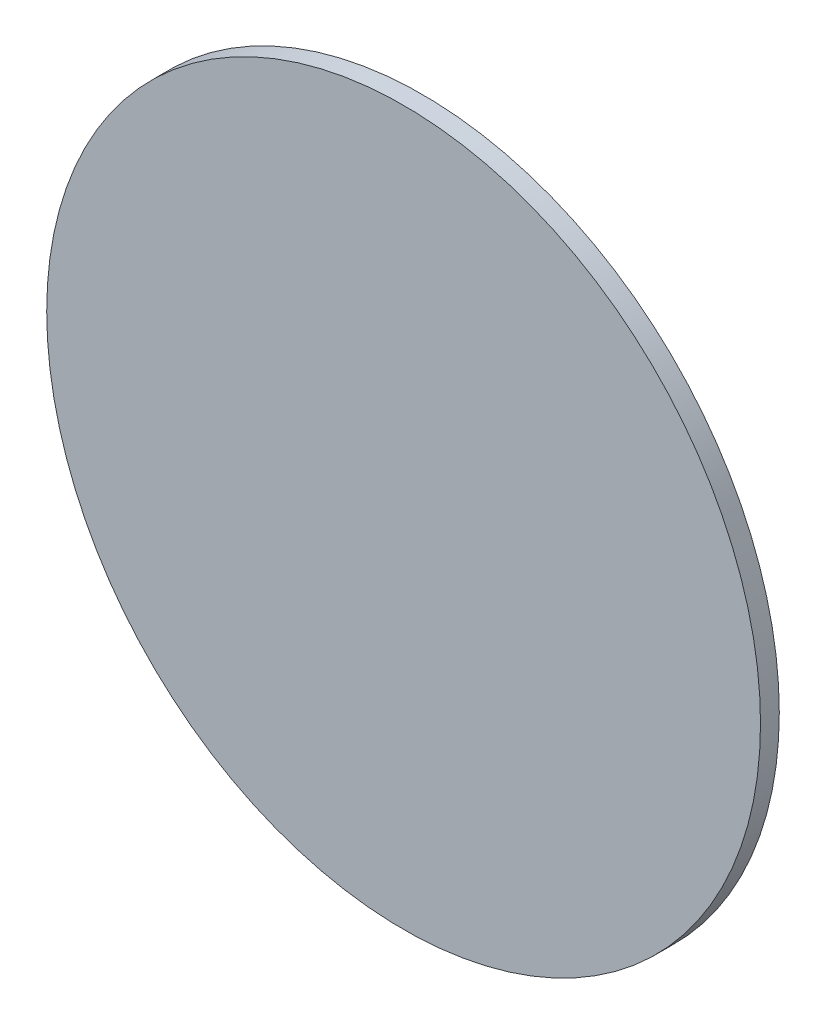
ISO-10303-21;
HEADER;
FILE_DESCRIPTION(('STEP AP214'),'2;1');
FILE_NAME('part.step','',(''),(''),'','','');
FILE_SCHEMA(('AUTOMOTIVE_DESIGN { 1 0 10303 214 1 1 1 1 }'));
ENDSEC;
DATA;
#1=APPLICATION_CONTEXT('core data for automotive mechanical design processes');
#2=APPLICATION_PROTOCOL_DEFINITION('international standard','automotive_design',2000,#1);
#3=PRODUCT_CONTEXT('',#1,'mechanical');
#4=PRODUCT('Part','Part','',(#3));
#5=PRODUCT_RELATED_PRODUCT_CATEGORY('part','',(#4));
#6=PRODUCT_DEFINITION_FORMATION('','',#4);
#7=PRODUCT_DEFINITION_CONTEXT('part definition',#1,'design');
#8=PRODUCT_DEFINITION('design','',#6,#7);
#9=PRODUCT_DEFINITION_SHAPE('','',#8);
#10=(LENGTH_UNIT() NAMED_UNIT(*) SI_UNIT(.MILLI.,.METRE.));
#11=(NAMED_UNIT(*) PLANE_ANGLE_UNIT() SI_UNIT($,.RADIAN.));
#12=(NAMED_UNIT(*) SI_UNIT($,.STERADIAN.) SOLID_ANGLE_UNIT());
#13=UNCERTAINTY_MEASURE_WITH_UNIT(LENGTH_MEASURE(1.E-05),#10,'distance_accuracy_value','');
#14=(GEOMETRIC_REPRESENTATION_CONTEXT(3) GLOBAL_UNCERTAINTY_ASSIGNED_CONTEXT((#13)) GLOBAL_UNIT_ASSIGNED_CONTEXT((#10,
#11,#12)) REPRESENTATION_CONTEXT('',''));
#15=CARTESIAN_POINT('',(0.,0.,0.));
#16=DIRECTION('',(0.,0.,1.));
#17=DIRECTION('',(1.,0.,0.));
#18=AXIS2_PLACEMENT_3D('',#15,#16,#17);
#19=CARTESIAN_POINT('',(0.,0.,0.4));
#20=DIRECTION('',(0.,0.,-1.));
#21=DIRECTION('',(-1.,0.,0.));
#22=AXIS2_PLACEMENT_3D('',#19,#20,#21);
#23=CYLINDRICAL_SURFACE('',#22,7.6);
#24=CARTESIAN_POINT('',(0.,0.,0.4));
#25=DIRECTION('',(0.,0.,1.));
#26=DIRECTION('',(1.,0.,0.));
#27=AXIS2_PLACEMENT_3D('',#24,#25,#26);
#28=CIRCLE('',#27,7.6);
#29=CARTESIAN_POINT('',(7.6,0.,0.4));
#30=VERTEX_POINT('',#29);
#31=EDGE_CURVE('E10',#30,#30,#28,.T.);
#32=ORIENTED_EDGE('',*,*,#31,.F.);
#33=EDGE_LOOP('',(#32));
#34=FACE_BOUND('',#33,.T.);
#35=CARTESIAN_POINT('',(0.,0.,0.));
#36=DIRECTION('',(0.,0.,1.));
#37=DIRECTION('',(1.,0.,0.));
#38=AXIS2_PLACEMENT_3D('',#35,#36,#37);
#39=CIRCLE('',#38,7.6);
#40=CARTESIAN_POINT('',(7.6,0.,0.));
#41=VERTEX_POINT('',#40);
#42=EDGE_CURVE('E33',#41,#41,#39,.T.);
#43=ORIENTED_EDGE('',*,*,#42,.T.);
#44=EDGE_LOOP('',(#43));
#45=FACE_BOUND('',#44,.T.);
#46=ADVANCED_FACE('F30',(#34,#45),#23,.T.);
#47=CARTESIAN_POINT('',(0.,0.,0.4));
#48=DIRECTION('',(0.,0.,1.));
#49=DIRECTION('',(1.,0.,0.));
#50=AXIS2_PLACEMENT_3D('',#47,#48,#49);
#51=PLANE('',#50);
#52=ORIENTED_EDGE('',*,*,#31,.T.);
#53=EDGE_LOOP('',(#52));
#54=FACE_BOUND('',#53,.T.);
#55=ADVANCED_FACE('F45',(#54),#51,.T.);
#56=CARTESIAN_POINT('',(0.,0.,0.));
#57=DIRECTION('',(0.,0.,1.));
#58=DIRECTION('',(1.,0.,0.));
#59=AXIS2_PLACEMENT_3D('',#56,#57,#58);
#60=PLANE('',#59);
#61=ORIENTED_EDGE('',*,*,#42,.F.);
#62=EDGE_LOOP('',(#61));
#63=FACE_BOUND('',#62,.T.);
#64=ADVANCED_FACE('F43',(#63),#60,.F.);
#65=CLOSED_SHELL('',(#46,#55,#64));
#66=MANIFOLD_SOLID_BREP('B2',#65);
#67=ADVANCED_BREP_SHAPE_REPRESENTATION('',(#18,#66),#14);
#68=SHAPE_DEFINITION_REPRESENTATION(#9,#67);
ENDSEC;
END-ISO-10303-21;
